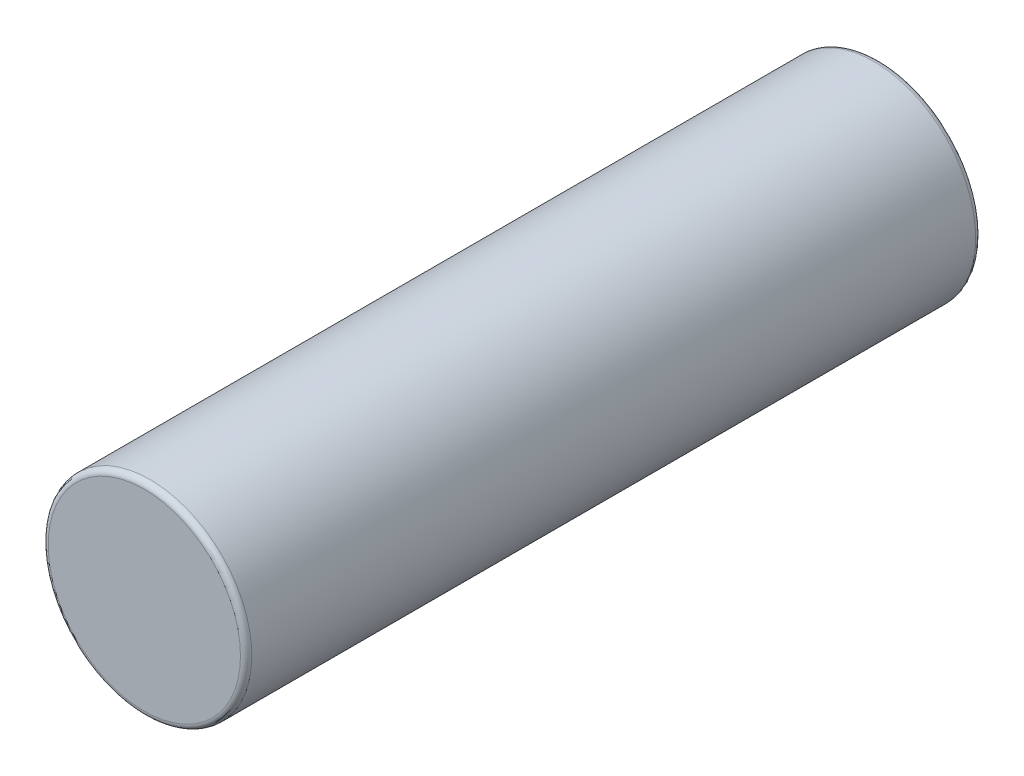
ISO-10303-21;
HEADER;
FILE_DESCRIPTION(('STEP AP214'),'2;1');
FILE_NAME('part.step','',(''),(''),'','','');
FILE_SCHEMA(('AUTOMOTIVE_DESIGN { 1 0 10303 214 1 1 1 1 }'));
ENDSEC;
DATA;
#1=APPLICATION_CONTEXT('core data for automotive mechanical design processes');
#2=APPLICATION_PROTOCOL_DEFINITION('international standard','automotive_design',2000,#1);
#3=PRODUCT_CONTEXT('',#1,'mechanical');
#4=PRODUCT('Part','Part','',(#3));
#5=PRODUCT_RELATED_PRODUCT_CATEGORY('part','',(#4));
#6=PRODUCT_DEFINITION_FORMATION('','',#4);
#7=PRODUCT_DEFINITION_CONTEXT('part definition',#1,'design');
#8=PRODUCT_DEFINITION('design','',#6,#7);
#9=PRODUCT_DEFINITION_SHAPE('','',#8);
#10=(LENGTH_UNIT() NAMED_UNIT(*) SI_UNIT(.MILLI.,.METRE.));
#11=(NAMED_UNIT(*) PLANE_ANGLE_UNIT() SI_UNIT($,.RADIAN.));
#12=(NAMED_UNIT(*) SI_UNIT($,.STERADIAN.) SOLID_ANGLE_UNIT());
#13=UNCERTAINTY_MEASURE_WITH_UNIT(LENGTH_MEASURE(1.E-05),#10,'distance_accuracy_value','');
#14=(GEOMETRIC_REPRESENTATION_CONTEXT(3) GLOBAL_UNCERTAINTY_ASSIGNED_CONTEXT((#13)) GLOBAL_UNIT_ASSIGNED_CONTEXT((#10,
#11,#12)) REPRESENTATION_CONTEXT('',''));
#15=CARTESIAN_POINT('',(0.,0.,0.));
#16=DIRECTION('',(0.,0.,1.));
#17=DIRECTION('',(1.,0.,0.));
#18=AXIS2_PLACEMENT_3D('',#15,#16,#17);
#19=CARTESIAN_POINT('',(0.,0.,65.));
#20=DIRECTION('',(0.,0.,-1.));
#21=DIRECTION('',(-1.,0.,0.));
#22=AXIS2_PLACEMENT_3D('',#19,#20,#21);
#23=CYLINDRICAL_SURFACE('',#22,9.);
#24=CARTESIAN_POINT('',(0.,0.,64.5));
#25=DIRECTION('',(0.,0.,1.));
#26=DIRECTION('',(1.,0.,0.));
#27=AXIS2_PLACEMENT_3D('',#24,#25,#26);
#28=CIRCLE('',#27,9.);
#29=CARTESIAN_POINT('',(9.,0.,64.5));
#30=VERTEX_POINT('',#29);
#31=EDGE_CURVE('E40',#30,#30,#28,.F.);
#32=ORIENTED_EDGE('',*,*,#31,.T.);
#33=EDGE_LOOP('',(#32));
#34=FACE_BOUND('',#33,.T.);
#35=CARTESIAN_POINT('',(0.,0.,0.5));
#36=DIRECTION('',(0.,0.,1.));
#37=DIRECTION('',(1.,0.,0.));
#38=AXIS2_PLACEMENT_3D('',#35,#36,#37);
#39=CIRCLE('',#38,9.);
#40=CARTESIAN_POINT('',(9.,0.,0.5));
#41=VERTEX_POINT('',#40);
#42=EDGE_CURVE('E44',#41,#41,#39,.T.);
#43=ORIENTED_EDGE('',*,*,#42,.T.);
#44=EDGE_LOOP('',(#43));
#45=FACE_BOUND('',#44,.T.);
#46=ADVANCED_FACE('F33',(#34,#45),#23,.T.);
#47=CARTESIAN_POINT('',(0.,0.,65.));
#48=DIRECTION('',(0.,0.,1.));
#49=DIRECTION('',(1.,0.,0.));
#50=AXIS2_PLACEMENT_3D('',#47,#48,#49);
#51=PLANE('',#50);
#52=CARTESIAN_POINT('',(0.,0.,65.));
#53=DIRECTION('',(0.,0.,1.));
#54=DIRECTION('',(1.,0.,0.));
#55=AXIS2_PLACEMENT_3D('',#52,#53,#54);
#56=CIRCLE('',#55,8.5);
#57=CARTESIAN_POINT('',(8.5,0.,65.));
#58=VERTEX_POINT('',#57);
#59=EDGE_CURVE('E48',#58,#58,#56,.T.);
#60=ORIENTED_EDGE('',*,*,#59,.T.);
#61=EDGE_LOOP('',(#60));
#62=FACE_BOUND('',#61,.T.);
#63=ADVANCED_FACE('F54',(#62),#51,.T.);
#64=CARTESIAN_POINT('',(0.,0.,0.));
#65=DIRECTION('',(0.,0.,1.));
#66=DIRECTION('',(1.,0.,0.));
#67=AXIS2_PLACEMENT_3D('',#64,#65,#66);
#68=PLANE('',#67);
#69=CARTESIAN_POINT('',(0.,0.,0.));
#70=DIRECTION('',(0.,0.,1.));
#71=DIRECTION('',(1.,0.,0.));
#72=AXIS2_PLACEMENT_3D('',#69,#70,#71);
#73=CIRCLE('',#72,8.5);
#74=CARTESIAN_POINT('',(8.5,0.,0.));
#75=VERTEX_POINT('',#74);
#76=EDGE_CURVE('E10',#75,#75,#73,.F.);
#77=ORIENTED_EDGE('',*,*,#76,.T.);
#78=EDGE_LOOP('',(#77));
#79=FACE_BOUND('',#78,.T.);
#80=ADVANCED_FACE('F58',(#79),#68,.F.);
#81=CARTESIAN_POINT('',(0.,0.,64.5));
#82=DIRECTION('',(0.,0.,1.));
#83=DIRECTION('',(1.,0.,0.));
#84=AXIS2_PLACEMENT_3D('',#81,#82,#83);
#85=TOROIDAL_SURFACE('',#84,8.5,0.5);
#86=ORIENTED_EDGE('',*,*,#31,.F.);
#87=EDGE_LOOP('',(#86));
#88=FACE_BOUND('',#87,.T.);
#89=ORIENTED_EDGE('',*,*,#59,.F.);
#90=EDGE_LOOP('',(#89));
#91=FACE_BOUND('',#90,.T.);
#92=ADVANCED_FACE('F56',(#88,#91),#85,.T.);
#93=CARTESIAN_POINT('',(0.,0.,0.5));
#94=DIRECTION('',(0.,0.,1.));
#95=DIRECTION('',(1.,0.,0.));
#96=AXIS2_PLACEMENT_3D('',#93,#94,#95);
#97=TOROIDAL_SURFACE('',#96,8.5,0.5);
#98=ORIENTED_EDGE('',*,*,#76,.F.);
#99=EDGE_LOOP('',(#98));
#100=FACE_BOUND('',#99,.T.);
#101=ORIENTED_EDGE('',*,*,#42,.F.);
#102=EDGE_LOOP('',(#101));
#103=FACE_BOUND('',#102,.T.);
#104=ADVANCED_FACE('F35',(#100,#103),#97,.T.);
#105=CLOSED_SHELL('',(#46,#63,#80,#92,#104));
#106=MANIFOLD_SOLID_BREP('B2',#105);
#107=ADVANCED_BREP_SHAPE_REPRESENTATION('',(#18,#106),#14);
#108=SHAPE_DEFINITION_REPRESENTATION(#9,#107);
ENDSEC;
END-ISO-10303-21;
